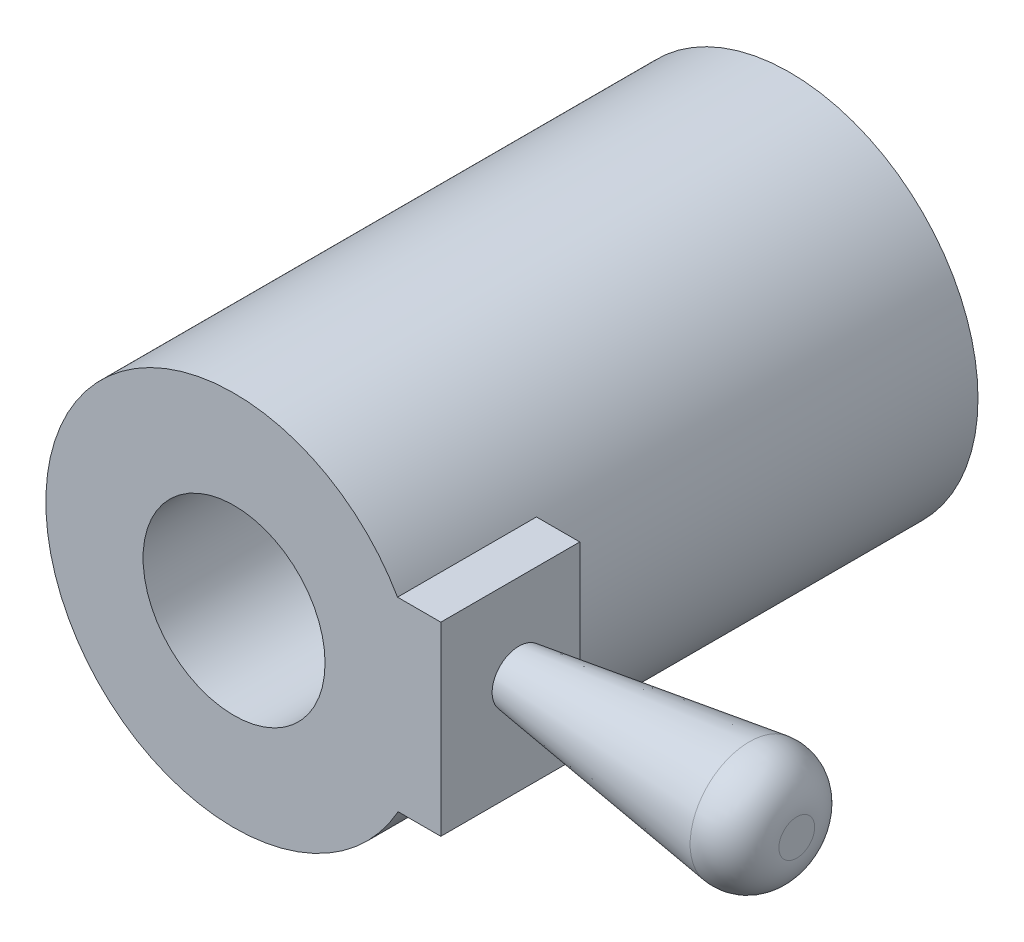
ISO-10303-21;
HEADER;
FILE_DESCRIPTION(('STEP AP214'),'2;1');
FILE_NAME('part.step','',(''),(''),'','','');
FILE_SCHEMA(('AUTOMOTIVE_DESIGN { 1 0 10303 214 1 1 1 1 }'));
ENDSEC;
DATA;
#1=APPLICATION_CONTEXT('core data for automotive mechanical design processes');
#2=APPLICATION_PROTOCOL_DEFINITION('international standard','automotive_design',2000,#1);
#3=PRODUCT_CONTEXT('',#1,'mechanical');
#4=PRODUCT('Part','Part','',(#3));
#5=PRODUCT_RELATED_PRODUCT_CATEGORY('part','',(#4));
#6=PRODUCT_DEFINITION_FORMATION('','',#4);
#7=PRODUCT_DEFINITION_CONTEXT('part definition',#1,'design');
#8=PRODUCT_DEFINITION('design','',#6,#7);
#9=PRODUCT_DEFINITION_SHAPE('','',#8);
#10=(LENGTH_UNIT() NAMED_UNIT(*) SI_UNIT(.MILLI.,.METRE.));
#11=(NAMED_UNIT(*) PLANE_ANGLE_UNIT() SI_UNIT($,.RADIAN.));
#12=(NAMED_UNIT(*) SI_UNIT($,.STERADIAN.) SOLID_ANGLE_UNIT());
#13=UNCERTAINTY_MEASURE_WITH_UNIT(LENGTH_MEASURE(1.E-05),#10,'distance_accuracy_value','');
#14=(GEOMETRIC_REPRESENTATION_CONTEXT(3) GLOBAL_UNCERTAINTY_ASSIGNED_CONTEXT((#13)) GLOBAL_UNIT_ASSIGNED_CONTEXT((#10,
#11,#12)) REPRESENTATION_CONTEXT('',''));
#15=CARTESIAN_POINT('',(0.,0.,0.));
#16=DIRECTION('',(0.,0.,1.));
#17=DIRECTION('',(1.,0.,0.));
#18=AXIS2_PLACEMENT_3D('',#15,#16,#17);
#19=CARTESIAN_POINT('',(37.8025125685476,17.0560149055983,76.2));
#20=DIRECTION('',(1.,0.,0.));
#21=DIRECTION('',(0.,0.,-1.));
#22=AXIS2_PLACEMENT_3D('',#19,#20,#21);
#23=PLANE('',#22);
#24=DIRECTION('',(0.,1.,0.));
#25=VECTOR('',#24,1.);
#26=CARTESIAN_POINT('',(37.8025125685476,17.0560149055983,101.6));
#27=LINE('',#26,#25);
#28=CARTESIAN_POINT('',(37.8025125685476,-16.8565293511462,101.6));
#29=VERTEX_POINT('',#28);
#30=CARTESIAN_POINT('',(37.8025125685476,17.0560149055983,101.6));
#31=VERTEX_POINT('',#30);
#32=EDGE_CURVE('E88',#29,#31,#27,.T.);
#33=ORIENTED_EDGE('',*,*,#32,.F.);
#34=DIRECTION('',(0.,0.,1.));
#35=VECTOR('',#34,1.);
#36=CARTESIAN_POINT('',(37.8025125685476,-16.8565293511462,76.2));
#37=LINE('',#36,#35);
#38=CARTESIAN_POINT('',(37.8025125685476,-16.8565293511462,76.2));
#39=VERTEX_POINT('',#38);
#40=EDGE_CURVE('E77',#39,#29,#37,.T.);
#41=ORIENTED_EDGE('',*,*,#40,.F.);
#42=DIRECTION('',(0.,1.,0.));
#43=VECTOR('',#42,1.);
#44=CARTESIAN_POINT('',(37.8025125685476,17.0560149055983,76.2));
#45=LINE('',#44,#43);
#46=CARTESIAN_POINT('',(37.8025125685476,17.0560149055983,76.2));
#47=VERTEX_POINT('',#46);
#48=EDGE_CURVE('E82',#39,#47,#45,.T.);
#49=ORIENTED_EDGE('',*,*,#48,.T.);
#50=DIRECTION('',(0.,0.,1.));
#51=VECTOR('',#50,1.);
#52=CARTESIAN_POINT('',(37.8025125685476,17.0560149055983,76.2));
#53=LINE('',#52,#51);
#54=EDGE_CURVE('E89',#47,#31,#53,.T.);
#55=ORIENTED_EDGE('',*,*,#54,.T.);
#56=EDGE_LOOP('',(#33,#41,#49,#55));
#57=FACE_BOUND('',#56,.T.);
#58=CARTESIAN_POINT('',(37.8025125685476,1.2265949103778,87.3249164308731));
#59=DIRECTION('',(1.,0.,0.));
#60=DIRECTION('',(0.,0.,-1.));
#61=AXIS2_PLACEMENT_3D('',#58,#59,#60);
#62=CIRCLE('',#61,4.89631778902469);
#63=CARTESIAN_POINT('',(37.8025125685476,1.2265949103778,82.4285986418485));
#64=VERTEX_POINT('',#63);
#65=EDGE_CURVE('E100',#64,#64,#62,.T.);
#66=ORIENTED_EDGE('',*,*,#65,.F.);
#67=EDGE_LOOP('',(#66));
#68=FACE_BOUND('',#67,.T.);
#69=ADVANCED_FACE('F33',(#57,#68),#23,.T.);
#70=CARTESIAN_POINT('',(0.,0.,101.6));
#71=DIRECTION('',(0.,0.,1.));
#72=DIRECTION('',(1.,0.,0.));
#73=AXIS2_PLACEMENT_3D('',#70,#71,#72);
#74=PLANE('',#73);
#75=DIRECTION('',(-1.,0.,0.));
#76=VECTOR('',#75,1.);
#77=CARTESIAN_POINT('',(21.644182657981,17.0560149055983,101.6));
#78=LINE('',#77,#76);
#79=CARTESIAN_POINT('',(29.8861773467583,17.0560149055983,101.6));
#80=VERTEX_POINT('',#79);
#81=EDGE_CURVE('E48',#31,#80,#78,.T.);
#82=ORIENTED_EDGE('',*,*,#81,.T.);
#83=CARTESIAN_POINT('',(0.,0.,101.6));
#84=DIRECTION('',(0.,0.,1.));
#85=DIRECTION('',(1.,0.,0.));
#86=AXIS2_PLACEMENT_3D('',#83,#84,#85);
#87=CIRCLE('',#86,34.4106268594729);
#88=CARTESIAN_POINT('',(29.9991443060603,-16.8565293511462,101.6));
#89=VERTEX_POINT('',#88);
#90=EDGE_CURVE('E111',#80,#89,#87,.T.);
#91=ORIENTED_EDGE('',*,*,#90,.T.);
#92=DIRECTION('',(1.,0.,0.));
#93=VECTOR('',#92,1.);
#94=CARTESIAN_POINT('',(21.644182657981,-16.8565293511462,101.6));
#95=LINE('',#94,#93);
#96=EDGE_CURVE('E98',#89,#29,#95,.T.);
#97=ORIENTED_EDGE('',*,*,#96,.T.);
#98=ORIENTED_EDGE('',*,*,#32,.T.);
#99=EDGE_LOOP('',(#82,#91,#97,#98));
#100=FACE_BOUND('',#99,.T.);
#101=CARTESIAN_POINT('',(0.,0.,101.6));
#102=DIRECTION('',(0.,0.,1.));
#103=DIRECTION('',(1.,0.,0.));
#104=AXIS2_PLACEMENT_3D('',#101,#102,#103);
#105=CIRCLE('',#104,16.637);
#106=CARTESIAN_POINT('',(16.637,0.,101.6));
#107=VERTEX_POINT('',#106);
#108=EDGE_CURVE('E105',#107,#107,#105,.T.);
#109=ORIENTED_EDGE('',*,*,#108,.F.);
#110=EDGE_LOOP('',(#109));
#111=FACE_BOUND('',#110,.T.);
#112=ADVANCED_FACE('F134',(#100,#111),#74,.T.);
#113=CARTESIAN_POINT('',(0.,0.,0.));
#114=DIRECTION('',(0.,0.,1.));
#115=DIRECTION('',(1.,0.,0.));
#116=AXIS2_PLACEMENT_3D('',#113,#114,#115);
#117=PLANE('',#116);
#118=CARTESIAN_POINT('',(0.,0.,0.));
#119=DIRECTION('',(0.,0.,1.));
#120=DIRECTION('',(1.,0.,0.));
#121=AXIS2_PLACEMENT_3D('',#118,#119,#120);
#122=CIRCLE('',#121,34.4106268594729);
#123=CARTESIAN_POINT('',(34.4106268594729,0.,0.));
#124=VERTEX_POINT('',#123);
#125=EDGE_CURVE('E108',#124,#124,#122,.T.);
#126=ORIENTED_EDGE('',*,*,#125,.F.);
#127=EDGE_LOOP('',(#126));
#128=FACE_BOUND('',#127,.T.);
#129=CARTESIAN_POINT('',(0.,0.,0.));
#130=DIRECTION('',(0.,0.,1.));
#131=DIRECTION('',(1.,0.,0.));
#132=AXIS2_PLACEMENT_3D('',#129,#130,#131);
#133=CIRCLE('',#132,16.637);
#134=CARTESIAN_POINT('',(16.637,0.,0.));
#135=VERTEX_POINT('',#134);
#136=EDGE_CURVE('E103',#135,#135,#133,.T.);
#137=ORIENTED_EDGE('',*,*,#136,.T.);
#138=EDGE_LOOP('',(#137));
#139=FACE_BOUND('',#138,.T.);
#140=ADVANCED_FACE('F139',(#128,#139),#117,.F.);
#141=CARTESIAN_POINT('',(0.,0.,101.6));
#142=DIRECTION('',(0.,0.,-1.));
#143=DIRECTION('',(-1.,0.,0.));
#144=AXIS2_PLACEMENT_3D('',#141,#142,#143);
#145=CYLINDRICAL_SURFACE('',#144,34.4106268594729);
#146=ORIENTED_EDGE('',*,*,#90,.F.);
#147=DIRECTION('',(0.,0.,-1.));
#148=VECTOR('',#147,1.);
#149=CARTESIAN_POINT('',(29.8861773467583,17.0560149055983,101.6));
#150=LINE('',#149,#148);
#151=CARTESIAN_POINT('',(29.8861773467583,17.0560149055983,76.2));
#152=VERTEX_POINT('',#151);
#153=EDGE_CURVE('E118',#80,#152,#150,.T.);
#154=ORIENTED_EDGE('',*,*,#153,.T.);
#155=CARTESIAN_POINT('',(0.,0.,76.2));
#156=DIRECTION('',(0.,0.,1.));
#157=DIRECTION('',(1.,0.,0.));
#158=AXIS2_PLACEMENT_3D('',#155,#156,#157);
#159=CIRCLE('',#158,34.4106268594729);
#160=CARTESIAN_POINT('',(29.9991443060603,-16.8565293511462,76.2));
#161=VERTEX_POINT('',#160);
#162=EDGE_CURVE('E113',#161,#152,#159,.T.);
#163=ORIENTED_EDGE('',*,*,#162,.F.);
#164=DIRECTION('',(0.,0.,-1.));
#165=VECTOR('',#164,1.);
#166=CARTESIAN_POINT('',(29.9991443060603,-16.8565293511462,101.6));
#167=LINE('',#166,#165);
#168=EDGE_CURVE('E56',#161,#89,#167,.F.);
#169=ORIENTED_EDGE('',*,*,#168,.T.);
#170=EDGE_LOOP('',(#146,#154,#163,#169));
#171=FACE_BOUND('',#170,.T.);
#172=ORIENTED_EDGE('',*,*,#125,.T.);
#173=EDGE_LOOP('',(#172));
#174=FACE_BOUND('',#173,.T.);
#175=ADVANCED_FACE('F149',(#171,#174),#145,.T.);
#176=CARTESIAN_POINT('',(0.,0.,101.6));
#177=DIRECTION('',(0.,0.,-1.));
#178=DIRECTION('',(-1.,0.,0.));
#179=AXIS2_PLACEMENT_3D('',#176,#177,#178);
#180=CYLINDRICAL_SURFACE('',#179,16.637);
#181=ORIENTED_EDGE('',*,*,#108,.T.);
#182=EDGE_LOOP('',(#181));
#183=FACE_BOUND('',#182,.T.);
#184=ORIENTED_EDGE('',*,*,#136,.F.);
#185=EDGE_LOOP('',(#184));
#186=FACE_BOUND('',#185,.T.);
#187=ADVANCED_FACE('F147',(#183,#186),#180,.F.);
#188=CARTESIAN_POINT('',(21.644182657981,17.0560149055983,76.2));
#189=DIRECTION('',(0.,1.,0.));
#190=DIRECTION('',(0.,0.,1.));
#191=AXIS2_PLACEMENT_3D('',#188,#189,#190);
#192=PLANE('',#191);
#193=ORIENTED_EDGE('',*,*,#153,.F.);
#194=ORIENTED_EDGE('',*,*,#81,.F.);
#195=ORIENTED_EDGE('',*,*,#54,.F.);
#196=DIRECTION('',(-1.,0.,0.));
#197=VECTOR('',#196,1.);
#198=CARTESIAN_POINT('',(21.644182657981,17.0560149055983,76.2));
#199=LINE('',#198,#197);
#200=EDGE_CURVE('E90',#47,#152,#199,.T.);
#201=ORIENTED_EDGE('',*,*,#200,.T.);
#202=EDGE_LOOP('',(#193,#194,#195,#201));
#203=FACE_BOUND('',#202,.T.);
#204=ADVANCED_FACE('F143',(#203),#192,.T.);
#205=CARTESIAN_POINT('',(21.644182657981,-16.8565293511462,76.2));
#206=DIRECTION('',(0.,-1.,0.));
#207=DIRECTION('',(0.,0.,-1.));
#208=AXIS2_PLACEMENT_3D('',#205,#206,#207);
#209=PLANE('',#208);
#210=ORIENTED_EDGE('',*,*,#168,.F.);
#211=DIRECTION('',(1.,0.,0.));
#212=VECTOR('',#211,1.);
#213=CARTESIAN_POINT('',(21.644182657981,-16.8565293511462,76.2));
#214=LINE('',#213,#212);
#215=EDGE_CURVE('E74',#161,#39,#214,.T.);
#216=ORIENTED_EDGE('',*,*,#215,.T.);
#217=ORIENTED_EDGE('',*,*,#40,.T.);
#218=ORIENTED_EDGE('',*,*,#96,.F.);
#219=EDGE_LOOP('',(#210,#216,#217,#218));
#220=FACE_BOUND('',#219,.T.);
#221=ADVANCED_FACE('F76',(#220),#209,.T.);
#222=CARTESIAN_POINT('',(0.,0.,76.2));
#223=DIRECTION('',(0.,0.,1.));
#224=DIRECTION('',(1.,0.,0.));
#225=AXIS2_PLACEMENT_3D('',#222,#223,#224);
#226=PLANE('',#225);
#227=ORIENTED_EDGE('',*,*,#215,.F.);
#228=ORIENTED_EDGE('',*,*,#162,.T.);
#229=ORIENTED_EDGE('',*,*,#200,.F.);
#230=ORIENTED_EDGE('',*,*,#48,.F.);
#231=EDGE_LOOP('',(#227,#228,#229,#230));
#232=FACE_BOUND('',#231,.T.);
#233=ADVANCED_FACE('F92',(#232),#226,.F.);
#234=CARTESIAN_POINT('',(37.8025125685476,1.2265949103778,87.3249164308731));
#235=DIRECTION('',(1.,0.,0.));
#236=DIRECTION('',(0.,0.,-1.));
#237=AXIS2_PLACEMENT_3D('',#234,#235,#236);
#238=CONICAL_SURFACE('',#237,4.89631778902469,0.139626340159546);
#239=CARTESIAN_POINT('',(79.9220135392318,1.2265949103778,87.3249164308731));
#240=DIRECTION('',(1.,0.,0.));
#241=DIRECTION('',(0.,0.,-1.));
#242=AXIS2_PLACEMENT_3D('',#239,#240,#241);
#243=CIRCLE('',#242,10.8158276126928);
#244=CARTESIAN_POINT('',(79.9220135392318,1.2265949103778,76.5090888181803));
#245=VERTEX_POINT('',#244);
#246=EDGE_CURVE('E11',#245,#245,#243,.F.);
#247=ORIENTED_EDGE('',*,*,#246,.T.);
#248=EDGE_LOOP('',(#247));
#249=FACE_BOUND('',#248,.T.);
#250=ORIENTED_EDGE('',*,*,#65,.T.);
#251=EDGE_LOOP('',(#250));
#252=FACE_BOUND('',#251,.T.);
#253=ADVANCED_FACE('F130',(#249,#252),#238,.T.);
#254=CARTESIAN_POINT('',(88.6025125685476,1.2265949103778,87.3249164308731));
#255=DIRECTION('',(1.,0.,0.));
#256=DIRECTION('',(0.,0.,-1.));
#257=AXIS2_PLACEMENT_3D('',#254,#255,#256);
#258=PLANE('',#257);
#259=CARTESIAN_POINT('',(88.6025125685476,1.2265949103778,87.3249164308731));
#260=DIRECTION('',(1.,0.,0.));
#261=DIRECTION('',(0.,0.,-1.));
#262=AXIS2_PLACEMENT_3D('',#259,#260,#261);
#263=CIRCLE('',#262,3.26998492888208);
#264=CARTESIAN_POINT('',(88.6025125685476,1.2265949103778,84.0549315019911));
#265=VERTEX_POINT('',#264);
#266=EDGE_CURVE('E41',#265,#265,#263,.T.);
#267=ORIENTED_EDGE('',*,*,#266,.T.);
#268=EDGE_LOOP('',(#267));
#269=FACE_BOUND('',#268,.T.);
#270=ADVANCED_FACE('F123',(#269),#258,.T.);
#271=CARTESIAN_POINT('',(80.9825125685475,1.2265949103778,87.3249164308731));
#272=DIRECTION('',(1.,0.,0.));
#273=DIRECTION('',(0.,0.,-1.));
#274=AXIS2_PLACEMENT_3D('',#271,#272,#273);
#275=DEGENERATE_TOROIDAL_SURFACE('',#274,3.26998492888208,7.62,.T.);
#276=ORIENTED_EDGE('',*,*,#246,.F.);
#277=EDGE_LOOP('',(#276));
#278=FACE_BOUND('',#277,.T.);
#279=ORIENTED_EDGE('',*,*,#266,.F.);
#280=EDGE_LOOP('',(#279));
#281=FACE_BOUND('',#280,.T.);
#282=ADVANCED_FACE('F35',(#278,#281),#275,.T.);
#283=CLOSED_SHELL('',(#69,#112,#140,#175,#187,#204,#221,#233,#253,#270,#282));
#284=MANIFOLD_SOLID_BREP('B2',#283);
#285=ADVANCED_BREP_SHAPE_REPRESENTATION('',(#18,#284),#14);
#286=SHAPE_DEFINITION_REPRESENTATION(#9,#285);
ENDSEC;
END-ISO-10303-21;
